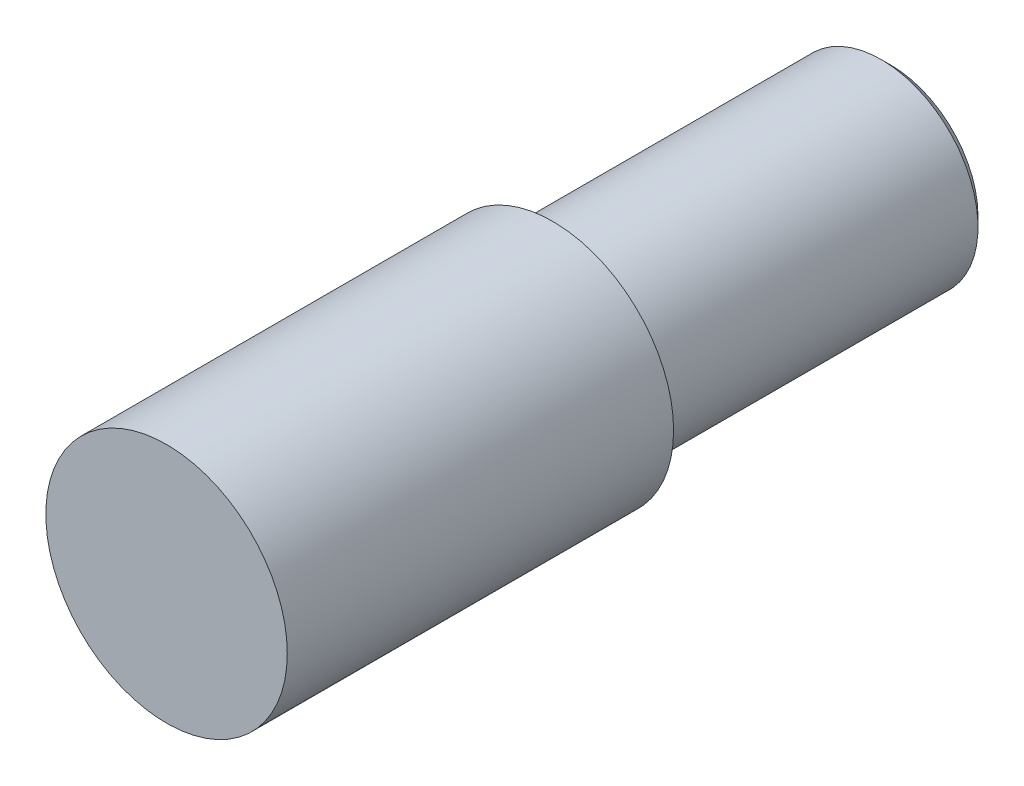
ISO-10303-21;
HEADER;
FILE_DESCRIPTION(('STEP AP214'),'2;1');
FILE_NAME('part.step','',(''),(''),'','','');
FILE_SCHEMA(('AUTOMOTIVE_DESIGN { 1 0 10303 214 1 1 1 1 }'));
ENDSEC;
DATA;
#1=APPLICATION_CONTEXT('core data for automotive mechanical design processes');
#2=APPLICATION_PROTOCOL_DEFINITION('international standard','automotive_design',2000,#1);
#3=PRODUCT_CONTEXT('',#1,'mechanical');
#4=PRODUCT('Part','Part','',(#3));
#5=PRODUCT_RELATED_PRODUCT_CATEGORY('part','',(#4));
#6=PRODUCT_DEFINITION_FORMATION('','',#4);
#7=PRODUCT_DEFINITION_CONTEXT('part definition',#1,'design');
#8=PRODUCT_DEFINITION('design','',#6,#7);
#9=PRODUCT_DEFINITION_SHAPE('','',#8);
#10=(LENGTH_UNIT() NAMED_UNIT(*) SI_UNIT(.MILLI.,.METRE.));
#11=(NAMED_UNIT(*) PLANE_ANGLE_UNIT() SI_UNIT($,.RADIAN.));
#12=(NAMED_UNIT(*) SI_UNIT($,.STERADIAN.) SOLID_ANGLE_UNIT());
#13=UNCERTAINTY_MEASURE_WITH_UNIT(LENGTH_MEASURE(1.E-05),#10,'distance_accuracy_value','');
#14=(GEOMETRIC_REPRESENTATION_CONTEXT(3) GLOBAL_UNCERTAINTY_ASSIGNED_CONTEXT((#13)) GLOBAL_UNIT_ASSIGNED_CONTEXT((#10,
#11,#12)) REPRESENTATION_CONTEXT('',''));
#15=CARTESIAN_POINT('',(0.,0.,0.));
#16=DIRECTION('',(0.,0.,1.));
#17=DIRECTION('',(1.,0.,0.));
#18=AXIS2_PLACEMENT_3D('',#15,#16,#17);
#19=CARTESIAN_POINT('',(0.,0.,-40.));
#20=DIRECTION('',(0.,0.,1.));
#21=DIRECTION('',(1.,0.,0.));
#22=AXIS2_PLACEMENT_3D('',#19,#20,#21);
#23=CYLINDRICAL_SURFACE('',#22,12.5);
#24=CARTESIAN_POINT('',(0.,0.,-40.));
#25=DIRECTION('',(0.,0.,1.));
#26=DIRECTION('',(1.,0.,0.));
#27=AXIS2_PLACEMENT_3D('',#24,#25,#26);
#28=CIRCLE('',#27,12.5);
#29=CARTESIAN_POINT('',(12.5,0.,-40.));
#30=VERTEX_POINT('',#29);
#31=EDGE_CURVE('E61',#30,#30,#28,.T.);
#32=ORIENTED_EDGE('',*,*,#31,.T.);
#33=EDGE_LOOP('',(#32));
#34=FACE_BOUND('',#33,.T.);
#35=CARTESIAN_POINT('',(0.,0.,0.));
#36=DIRECTION('',(0.,0.,1.));
#37=DIRECTION('',(1.,0.,0.));
#38=AXIS2_PLACEMENT_3D('',#35,#36,#37);
#39=CIRCLE('',#38,12.5);
#40=CARTESIAN_POINT('',(12.5,0.,0.));
#41=VERTEX_POINT('',#40);
#42=EDGE_CURVE('E64',#41,#41,#39,.T.);
#43=ORIENTED_EDGE('',*,*,#42,.F.);
#44=EDGE_LOOP('',(#43));
#45=FACE_BOUND('',#44,.T.);
#46=ADVANCED_FACE('F40',(#34,#45),#23,.T.);
#47=CARTESIAN_POINT('',(0.,0.,-40.));
#48=DIRECTION('',(0.,0.,1.));
#49=DIRECTION('',(1.,0.,0.));
#50=AXIS2_PLACEMENT_3D('',#47,#48,#49);
#51=PLANE('',#50);
#52=CARTESIAN_POINT('',(0.,0.,-40.));
#53=DIRECTION('',(0.,0.,-1.));
#54=DIRECTION('',(-1.,0.,0.));
#55=AXIS2_PLACEMENT_3D('',#52,#53,#54);
#56=CIRCLE('',#55,10.02);
#57=CARTESIAN_POINT('',(-10.02,0.,-40.));
#58=VERTEX_POINT('',#57);
#59=EDGE_CURVE('E55',#58,#58,#56,.T.);
#60=ORIENTED_EDGE('',*,*,#59,.F.);
#61=EDGE_LOOP('',(#60));
#62=FACE_BOUND('',#61,.T.);
#63=ORIENTED_EDGE('',*,*,#31,.F.);
#64=EDGE_LOOP('',(#63));
#65=FACE_BOUND('',#64,.T.);
#66=ADVANCED_FACE('F75',(#62,#65),#51,.F.);
#67=CARTESIAN_POINT('',(0.,0.,0.));
#68=DIRECTION('',(0.,0.,1.));
#69=DIRECTION('',(1.,0.,0.));
#70=AXIS2_PLACEMENT_3D('',#67,#68,#69);
#71=PLANE('',#70);
#72=ORIENTED_EDGE('',*,*,#42,.T.);
#73=EDGE_LOOP('',(#72));
#74=FACE_BOUND('',#73,.T.);
#75=ADVANCED_FACE('F77',(#74),#71,.T.);
#76=CARTESIAN_POINT('',(0.,0.,-75.));
#77=DIRECTION('',(0.,0.,1.));
#78=DIRECTION('',(1.,0.,0.));
#79=AXIS2_PLACEMENT_3D('',#76,#77,#78);
#80=CYLINDRICAL_SURFACE('',#79,10.02);
#81=CARTESIAN_POINT('',(0.,0.,-74.));
#82=DIRECTION('',(0.,0.,-1.));
#83=DIRECTION('',(-1.,0.,0.));
#84=AXIS2_PLACEMENT_3D('',#81,#82,#83);
#85=CIRCLE('',#84,10.02);
#86=CARTESIAN_POINT('',(-10.02,0.,-74.));
#87=VERTEX_POINT('',#86);
#88=EDGE_CURVE('E10',#87,#87,#85,.F.);
#89=ORIENTED_EDGE('',*,*,#88,.T.);
#90=EDGE_LOOP('',(#89));
#91=FACE_BOUND('',#90,.T.);
#92=ORIENTED_EDGE('',*,*,#59,.T.);
#93=EDGE_LOOP('',(#92));
#94=FACE_BOUND('',#93,.T.);
#95=ADVANCED_FACE('F84',(#91,#94),#80,.T.);
#96=CARTESIAN_POINT('',(0.,0.,-75.));
#97=DIRECTION('',(0.,0.,-1.));
#98=DIRECTION('',(-1.,0.,0.));
#99=AXIS2_PLACEMENT_3D('',#96,#97,#98);
#100=PLANE('',#99);
#101=CARTESIAN_POINT('',(0.,0.,-75.));
#102=DIRECTION('',(0.,0.,-1.));
#103=DIRECTION('',(-1.,0.,0.));
#104=AXIS2_PLACEMENT_3D('',#101,#102,#103);
#105=CIRCLE('',#104,9.02);
#106=CARTESIAN_POINT('',(-9.02,0.,-75.));
#107=VERTEX_POINT('',#106);
#108=EDGE_CURVE('E49',#107,#107,#105,.T.);
#109=ORIENTED_EDGE('',*,*,#108,.T.);
#110=EDGE_LOOP('',(#109));
#111=FACE_BOUND('',#110,.T.);
#112=ADVANCED_FACE('F91',(#111),#100,.T.);
#113=CARTESIAN_POINT('',(0.,0.,-75.));
#114=DIRECTION('',(0.,0.,1.));
#115=DIRECTION('',(1.,0.,0.));
#116=AXIS2_PLACEMENT_3D('',#113,#114,#115);
#117=CONICAL_SURFACE('',#116,9.02,0.785398163397447);
#118=ORIENTED_EDGE('',*,*,#88,.F.);
#119=EDGE_LOOP('',(#118));
#120=FACE_BOUND('',#119,.T.);
#121=ORIENTED_EDGE('',*,*,#108,.F.);
#122=EDGE_LOOP('',(#121));
#123=FACE_BOUND('',#122,.T.);
#124=ADVANCED_FACE('F43',(#120,#123),#117,.T.);
#125=CLOSED_SHELL('',(#46,#66,#75,#95,#112,#124));
#126=MANIFOLD_SOLID_BREP('B2',#125);
#127=ADVANCED_BREP_SHAPE_REPRESENTATION('',(#18,#126),#14);
#128=SHAPE_DEFINITION_REPRESENTATION(#9,#127);
ENDSEC;
END-ISO-10303-21;
